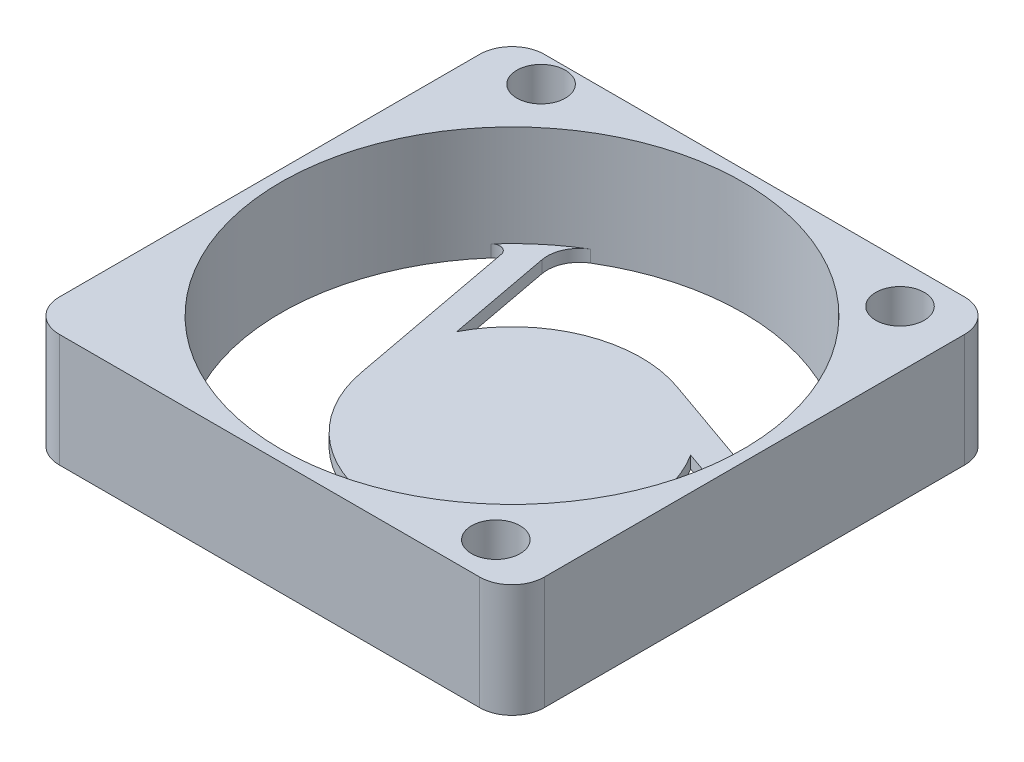
ISO-10303-21;
HEADER;
FILE_DESCRIPTION(('STEP AP214'),'2;1');
FILE_NAME('part.step','',(''),(''),'','','');
FILE_SCHEMA(('AUTOMOTIVE_DESIGN { 1 0 10303 214 1 1 1 1 }'));
ENDSEC;
DATA;
#1=APPLICATION_CONTEXT('core data for automotive mechanical design processes');
#2=APPLICATION_PROTOCOL_DEFINITION('international standard','automotive_design',2000,#1);
#3=PRODUCT_CONTEXT('',#1,'mechanical');
#4=PRODUCT('Part','Part','',(#3));
#5=PRODUCT_RELATED_PRODUCT_CATEGORY('part','',(#4));
#6=PRODUCT_DEFINITION_FORMATION('','',#4);
#7=PRODUCT_DEFINITION_CONTEXT('part definition',#1,'design');
#8=PRODUCT_DEFINITION('design','',#6,#7);
#9=PRODUCT_DEFINITION_SHAPE('','',#8);
#10=(LENGTH_UNIT() NAMED_UNIT(*) SI_UNIT(.MILLI.,.METRE.));
#11=(NAMED_UNIT(*) PLANE_ANGLE_UNIT() SI_UNIT($,.RADIAN.));
#12=(NAMED_UNIT(*) SI_UNIT($,.STERADIAN.) SOLID_ANGLE_UNIT());
#13=UNCERTAINTY_MEASURE_WITH_UNIT(LENGTH_MEASURE(1.E-05),#10,'distance_accuracy_value','');
#14=(GEOMETRIC_REPRESENTATION_CONTEXT(3) GLOBAL_UNCERTAINTY_ASSIGNED_CONTEXT((#13)) GLOBAL_UNIT_ASSIGNED_CONTEXT((#10,
#11,#12)) REPRESENTATION_CONTEXT('',''));
#15=CARTESIAN_POINT('',(0.,0.,0.));
#16=DIRECTION('',(0.,0.,1.));
#17=DIRECTION('',(1.,0.,0.));
#18=AXIS2_PLACEMENT_3D('',#15,#16,#17);
#19=CARTESIAN_POINT('',(13.,0.,13.));
#20=DIRECTION('',(0.,1.,0.));
#21=DIRECTION('',(0.,0.,1.));
#22=AXIS2_PLACEMENT_3D('',#19,#20,#21);
#23=PLANE('',#22);
#24=CARTESIAN_POINT('',(0.,0.,0.));
#25=DIRECTION('',(0.,1.,0.));
#26=DIRECTION('',(0.,0.,1.));
#27=AXIS2_PLACEMENT_3D('',#24,#25,#26);
#28=CIRCLE('',#27,8.);
#29=CARTESIAN_POINT('',(6.74049606659327,0.,-4.30879481714326));
#30=VERTEX_POINT('',#29);
#31=CARTESIAN_POINT('',(5.2099932184376,0.,6.0709118478069));
#32=VERTEX_POINT('',#31);
#33=EDGE_CURVE('E305',#30,#32,#28,.F.);
#34=ORIENTED_EDGE('',*,*,#33,.T.);
#35=DIRECTION('',(0.758863980975885,0.,-0.651249152304578));
#36=VECTOR('',#35,1.);
#37=CARTESIAN_POINT('',(5.20999321843695,0.,6.07091184780746));
#38=LINE('',#37,#36);
#39=CARTESIAN_POINT('',(-3.0400135739461,0.,13.1509816162225));
#40=VERTEX_POINT('',#39);
#41=EDGE_CURVE('E282',#40,#32,#38,.T.);
#42=ORIENTED_EDGE('',*,*,#41,.F.);
#43=CARTESIAN_POINT('',(-2.71438899779381,0.,13.5304136067105));
#44=DIRECTION('',(0.,1.,0.));
#45=DIRECTION('',(0.,0.,1.));
#46=AXIS2_PLACEMENT_3D('',#43,#44,#45);
#47=CIRCLE('',#46,0.5);
#48=CARTESIAN_POINT('',(-2.81273642525011,0.,14.0206459837652));
#49=VERTEX_POINT('',#48);
#50=EDGE_CURVE('E12',#40,#49,#47,.T.);
#51=ORIENTED_EDGE('',*,*,#50,.T.);
#52=CARTESIAN_POINT('',(0.,0.,0.));
#53=DIRECTION('',(0.,1.,0.));
#54=DIRECTION('',(0.,0.,1.));
#55=AXIS2_PLACEMENT_3D('',#52,#53,#54);
#56=CIRCLE('',#55,14.3);
#57=CARTESIAN_POINT('',(14.297372810482,0.,-0.274099832340589));
#58=VERTEX_POINT('',#57);
#59=EDGE_CURVE('E301',#58,#49,#56,.F.);
#60=ORIENTED_EDGE('',*,*,#59,.F.);
#61=CARTESIAN_POINT('',(12.2977402495755,0.,-0.235764191453794));
#62=DIRECTION('',(0.,1.,0.));
#63=DIRECTION('',(0.,0.,1.));
#64=AXIS2_PLACEMENT_3D('',#61,#62,#63);
#65=CIRCLE('',#64,2.);
#66=CARTESIAN_POINT('',(12.9608820683551,0.,-2.12262479260737));
#67=VERTEX_POINT('',#66);
#68=EDGE_CURVE('E464',#58,#67,#65,.T.);
#69=ORIENTED_EDGE('',*,*,#68,.T.);
#70=DIRECTION('',(0.943430300576788,0.,0.331570909389818));
#71=VECTOR('',#70,1.);
#72=CARTESIAN_POINT('',(2.08889672915586,0.,-5.94361089363377));
#73=LINE('',#72,#71);
#74=EDGE_CURVE('E652',#30,#67,#73,.T.);
#75=ORIENTED_EDGE('',*,*,#74,.F.);
#76=EDGE_LOOP('',(#34,#42,#51,#60,#69,#75));
#77=FACE_BOUND('',#76,.T.);
#78=CARTESIAN_POINT('',(11.5,0.,12.5));
#79=DIRECTION('',(0.,1.,0.));
#80=DIRECTION('',(0.,0.,-1.));
#81=AXIS2_PLACEMENT_3D('',#78,#79,#80);
#82=CIRCLE('',#81,1.5);
#83=CARTESIAN_POINT('',(11.5,0.,11.));
#84=VERTEX_POINT('',#83);
#85=EDGE_CURVE('E356',#84,#84,#82,.T.);
#86=ORIENTED_EDGE('',*,*,#85,.T.);
#87=EDGE_LOOP('',(#86));
#88=FACE_BOUND('',#87,.T.);
#89=CARTESIAN_POINT('',(11.5,0.,-12.5));
#90=DIRECTION('',(0.,1.,0.));
#91=DIRECTION('',(0.,0.,1.));
#92=AXIS2_PLACEMENT_3D('',#89,#90,#91);
#93=CIRCLE('',#92,1.5);
#94=CARTESIAN_POINT('',(11.5,0.,-11.));
#95=VERTEX_POINT('',#94);
#96=EDGE_CURVE('E364',#95,#95,#93,.T.);
#97=ORIENTED_EDGE('',*,*,#96,.T.);
#98=EDGE_LOOP('',(#97));
#99=FACE_BOUND('',#98,.T.);
#100=CARTESIAN_POINT('',(-11.5,0.,-13.3));
#101=DIRECTION('',(0.,1.,0.));
#102=DIRECTION('',(0.,0.,1.));
#103=AXIS2_PLACEMENT_3D('',#100,#101,#102);
#104=CIRCLE('',#103,1.5);
#105=CARTESIAN_POINT('',(-11.5,0.,-11.8));
#106=VERTEX_POINT('',#105);
#107=EDGE_CURVE('E370',#106,#106,#104,.T.);
#108=ORIENTED_EDGE('',*,*,#107,.T.);
#109=EDGE_LOOP('',(#108));
#110=FACE_BOUND('',#109,.T.);
#111=CARTESIAN_POINT('',(13.,0.,13.));
#112=DIRECTION('',(0.,1.,0.));
#113=DIRECTION('',(0.,0.,1.));
#114=AXIS2_PLACEMENT_3D('',#111,#112,#113);
#115=CIRCLE('',#114,2.);
#116=CARTESIAN_POINT('',(13.,0.,15.));
#117=VERTEX_POINT('',#116);
#118=CARTESIAN_POINT('',(15.,0.,13.));
#119=VERTEX_POINT('',#118);
#120=EDGE_CURVE('E376',#117,#119,#115,.T.);
#121=ORIENTED_EDGE('',*,*,#120,.F.);
#122=DIRECTION('',(1.,0.,0.));
#123=VECTOR('',#122,1.);
#124=CARTESIAN_POINT('',(-13.,0.,15.));
#125=LINE('',#124,#123);
#126=CARTESIAN_POINT('',(-13.,0.,15.));
#127=VERTEX_POINT('',#126);
#128=EDGE_CURVE('E383',#127,#117,#125,.T.);
#129=ORIENTED_EDGE('',*,*,#128,.F.);
#130=CARTESIAN_POINT('',(-13.,0.,13.));
#131=DIRECTION('',(0.,1.,0.));
#132=DIRECTION('',(0.,0.,-1.));
#133=AXIS2_PLACEMENT_3D('',#130,#131,#132);
#134=CIRCLE('',#133,2.);
#135=CARTESIAN_POINT('',(-15.,0.,13.));
#136=VERTEX_POINT('',#135);
#137=EDGE_CURVE('E410',#136,#127,#134,.T.);
#138=ORIENTED_EDGE('',*,*,#137,.F.);
#139=DIRECTION('',(0.,0.,1.));
#140=VECTOR('',#139,1.);
#141=CARTESIAN_POINT('',(-15.,0.,13.));
#142=LINE('',#141,#140);
#143=CARTESIAN_POINT('',(-15.,0.,-13.));
#144=VERTEX_POINT('',#143);
#145=EDGE_CURVE('E408',#144,#136,#142,.T.);
#146=ORIENTED_EDGE('',*,*,#145,.F.);
#147=CARTESIAN_POINT('',(-13.,0.,-13.));
#148=DIRECTION('',(0.,1.,0.));
#149=DIRECTION('',(0.,0.,-1.));
#150=AXIS2_PLACEMENT_3D('',#147,#148,#149);
#151=CIRCLE('',#150,2.);
#152=CARTESIAN_POINT('',(-13.,0.,-15.));
#153=VERTEX_POINT('',#152);
#154=EDGE_CURVE('E406',#153,#144,#151,.T.);
#155=ORIENTED_EDGE('',*,*,#154,.F.);
#156=DIRECTION('',(-1.,0.,0.));
#157=VECTOR('',#156,1.);
#158=CARTESIAN_POINT('',(-13.,0.,-15.));
#159=LINE('',#158,#157);
#160=CARTESIAN_POINT('',(13.,0.,-15.));
#161=VERTEX_POINT('',#160);
#162=EDGE_CURVE('E404',#161,#153,#159,.T.);
#163=ORIENTED_EDGE('',*,*,#162,.F.);
#164=CARTESIAN_POINT('',(13.,0.,-13.));
#165=DIRECTION('',(0.,1.,0.));
#166=DIRECTION('',(0.,0.,-1.));
#167=AXIS2_PLACEMENT_3D('',#164,#165,#166);
#168=CIRCLE('',#167,2.);
#169=CARTESIAN_POINT('',(15.,0.,-13.));
#170=VERTEX_POINT('',#169);
#171=EDGE_CURVE('E402',#170,#161,#168,.T.);
#172=ORIENTED_EDGE('',*,*,#171,.F.);
#173=DIRECTION('',(0.,0.,-1.));
#174=VECTOR('',#173,1.);
#175=CARTESIAN_POINT('',(15.,0.,13.));
#176=LINE('',#175,#174);
#177=EDGE_CURVE('E400',#119,#170,#176,.T.);
#178=ORIENTED_EDGE('',*,*,#177,.F.);
#179=EDGE_LOOP('',(#121,#129,#138,#146,#155,#163,#172,#178));
#180=FACE_BOUND('',#179,.T.);
#181=CARTESIAN_POINT('',(0.,0.,0.));
#182=DIRECTION('',(0.,1.,0.));
#183=DIRECTION('',(0.,0.,1.));
#184=AXIS2_PLACEMENT_3D('',#181,#182,#183);
#185=CIRCLE('',#184,8.);
#186=CARTESIAN_POINT('',(0.361277738045123,0.,7.99183823635031));
#187=VERTEX_POINT('',#186);
#188=CARTESIAN_POINT('',(-7.86256049355453,0.,1.47653055680798));
#189=VERTEX_POINT('',#188);
#190=EDGE_CURVE('E337',#187,#189,#185,.F.);
#191=ORIENTED_EDGE('',*,*,#190,.T.);
#192=DIRECTION('',(0.184566319600904,0.,0.982820061694397));
#193=VECTOR('',#192,1.);
#194=CARTESIAN_POINT('',(-7.86256049355469,0.,1.47653055680714));
#195=LINE('',#194,#193);
#196=CARTESIAN_POINT('',(-9.86907737737697,0.,-9.20821979099905));
#197=VERTEX_POINT('',#196);
#198=EDGE_CURVE('E340',#197,#189,#195,.T.);
#199=ORIENTED_EDGE('',*,*,#198,.F.);
#200=CARTESIAN_POINT('',(-10.3604874082242,0.,-9.11593663119859));
#201=DIRECTION('',(0.,1.,0.));
#202=DIRECTION('',(0.,0.,1.));
#203=AXIS2_PLACEMENT_3D('',#200,#201,#202);
#204=CIRCLE('',#203,0.5);
#205=CARTESIAN_POINT('',(-10.735867386783,0.,-9.44622419029999));
#206=VERTEX_POINT('',#205);
#207=EDGE_CURVE('E482',#197,#206,#204,.T.);
#208=ORIENTED_EDGE('',*,*,#207,.T.);
#209=CARTESIAN_POINT('',(0.,0.,0.));
#210=DIRECTION('',(0.,1.,0.));
#211=DIRECTION('',(0.,0.,1.));
#212=AXIS2_PLACEMENT_3D('',#209,#210,#211);
#213=CIRCLE('',#212,14.3);
#214=CARTESIAN_POINT('',(-6.91130898726047,0.,12.5189379774249));
#215=VERTEX_POINT('',#214);
#216=EDGE_CURVE('E330',#215,#206,#213,.F.);
#217=ORIENTED_EDGE('',*,*,#216,.F.);
#218=CARTESIAN_POINT('',(-5.94469234568558,0.,10.7680375610019));
#219=DIRECTION('',(0.,1.,0.));
#220=DIRECTION('',(0.,0.,1.));
#221=AXIS2_PLACEMENT_3D('',#218,#219,#220);
#222=CIRCLE('',#221,2.);
#223=CARTESIAN_POINT('',(-4.64219404107642,0.,12.2857655229536));
#224=VERTEX_POINT('',#223);
#225=EDGE_CURVE('E459',#215,#224,#222,.T.);
#226=ORIENTED_EDGE('',*,*,#225,.T.);
#227=DIRECTION('',(-0.758863980975885,0.,0.651249152304579));
#228=VECTOR('',#227,1.);
#229=CARTESIAN_POINT('',(4.10286965951916,0.,4.78084308014845));
#230=LINE('',#229,#228);
#231=EDGE_CURVE('E333',#187,#224,#230,.T.);
#232=ORIENTED_EDGE('',*,*,#231,.F.);
#233=EDGE_LOOP('',(#191,#199,#208,#217,#226,#232));
#234=FACE_BOUND('',#233,.T.);
#235=CARTESIAN_POINT('',(0.,0.,0.));
#236=DIRECTION('',(0.,1.,0.));
#237=DIRECTION('',(0.,0.,1.));
#238=AXIS2_PLACEMENT_3D('',#235,#236,#237);
#239=CIRCLE('',#238,8.);
#240=CARTESIAN_POINT('',(-7.10177380463679,0.,-3.68304341920648));
#241=VERTEX_POINT('',#240);
#242=CARTESIAN_POINT('',(2.65256727511854,0.,-7.5474424046143));
#243=VERTEX_POINT('',#242);
#244=EDGE_CURVE('E313',#241,#243,#239,.F.);
#245=ORIENTED_EDGE('',*,*,#244,.T.);
#246=DIRECTION('',(-0.943430300576788,0.,-0.331570909389818));
#247=VECTOR('',#246,1.);
#248=CARTESIAN_POINT('',(2.65256727511855,0.,-7.5474424046143));
#249=LINE('',#248,#247);
#250=CARTESIAN_POINT('',(12.9090909513241,0.,-3.94276182522382));
#251=VERTEX_POINT('',#250);
#252=EDGE_CURVE('E316',#251,#243,#249,.T.);
#253=ORIENTED_EDGE('',*,*,#252,.F.);
#254=CARTESIAN_POINT('',(13.074876406019,0.,-4.41447697551221));
#255=DIRECTION('',(0.,1.,0.));
#256=DIRECTION('',(0.,0.,1.));
#257=AXIS2_PLACEMENT_3D('',#254,#255,#256);
#258=CIRCLE('',#257,0.5);
#259=CARTESIAN_POINT('',(13.5486038120342,0.,-4.57442179346556));
#260=VERTEX_POINT('',#259);
#261=EDGE_CURVE('E486',#251,#260,#258,.T.);
#262=ORIENTED_EDGE('',*,*,#261,.T.);
#263=CARTESIAN_POINT('',(0.,0.,0.));
#264=DIRECTION('',(0.,1.,0.));
#265=DIRECTION('',(0.,0.,1.));
#266=AXIS2_PLACEMENT_3D('',#263,#264,#265);
#267=CIRCLE('',#266,14.3);
#268=CARTESIAN_POINT('',(-7.38606382322051,0.,-12.2448381450844));
#269=VERTEX_POINT('',#268);
#270=EDGE_CURVE('E306',#269,#260,#267,.F.);
#271=ORIENTED_EDGE('',*,*,#270,.F.);
#272=CARTESIAN_POINT('',(-6.35304790388897,0.,-10.5322733695481));
#273=DIRECTION('',(0.,1.,0.));
#274=DIRECTION('',(0.,0.,1.));
#275=AXIS2_PLACEMENT_3D('',#272,#273,#274);
#276=CIRCLE('',#275,2.);
#277=CARTESIAN_POINT('',(-8.31868802727776,0.,-10.1631407303463));
#278=VERTEX_POINT('',#277);
#279=EDGE_CURVE('E454',#269,#278,#276,.T.);
#280=ORIENTED_EDGE('',*,*,#279,.T.);
#281=DIRECTION('',(-0.184566319600904,0.,-0.982820061694396));
#282=VECTOR('',#281,1.);
#283=CARTESIAN_POINT('',(-6.19176638867421,0.,1.1627678134856));
#284=LINE('',#283,#282);
#285=EDGE_CURVE('E309',#241,#278,#284,.T.);
#286=ORIENTED_EDGE('',*,*,#285,.F.);
#287=EDGE_LOOP('',(#245,#253,#262,#271,#280,#286));
#288=FACE_BOUND('',#287,.T.);
#289=ADVANCED_FACE('F108',(#77,#88,#99,#110,#180,#234,#288),#23,.F.);
#290=CARTESIAN_POINT('',(13.,7.,13.));
#291=DIRECTION('',(0.,1.,0.));
#292=DIRECTION('',(0.,0.,1.));
#293=AXIS2_PLACEMENT_3D('',#290,#291,#292);
#294=PLANE('',#293);
#295=CARTESIAN_POINT('',(0.,7.,0.));
#296=DIRECTION('',(0.,1.,0.));
#297=DIRECTION('',(0.,0.,1.));
#298=AXIS2_PLACEMENT_3D('',#295,#296,#297);
#299=CIRCLE('',#298,14.3);
#300=CARTESIAN_POINT('',(0.,7.,14.3));
#301=VERTEX_POINT('',#300);
#302=EDGE_CURVE('E353',#301,#301,#299,.T.);
#303=ORIENTED_EDGE('',*,*,#302,.F.);
#304=EDGE_LOOP('',(#303));
#305=FACE_BOUND('',#304,.T.);
#306=CARTESIAN_POINT('',(11.5,7.,-12.5));
#307=DIRECTION('',(0.,1.,0.));
#308=DIRECTION('',(0.,0.,1.));
#309=AXIS2_PLACEMENT_3D('',#306,#307,#308);
#310=CIRCLE('',#309,1.5);
#311=CARTESIAN_POINT('',(11.5,7.,-11.));
#312=VERTEX_POINT('',#311);
#313=EDGE_CURVE('E367',#312,#312,#310,.T.);
#314=ORIENTED_EDGE('',*,*,#313,.F.);
#315=EDGE_LOOP('',(#314));
#316=FACE_BOUND('',#315,.T.);
#317=CARTESIAN_POINT('',(13.,7.,13.));
#318=DIRECTION('',(0.,1.,0.));
#319=DIRECTION('',(0.,0.,1.));
#320=AXIS2_PLACEMENT_3D('',#317,#318,#319);
#321=CIRCLE('',#320,2.);
#322=CARTESIAN_POINT('',(13.,7.,15.));
#323=VERTEX_POINT('',#322);
#324=CARTESIAN_POINT('',(15.,7.,13.));
#325=VERTEX_POINT('',#324);
#326=EDGE_CURVE('E379',#323,#325,#321,.T.);
#327=ORIENTED_EDGE('',*,*,#326,.T.);
#328=DIRECTION('',(0.,0.,-1.));
#329=VECTOR('',#328,1.);
#330=CARTESIAN_POINT('',(15.,7.,13.));
#331=LINE('',#330,#329);
#332=CARTESIAN_POINT('',(15.,7.,-13.));
#333=VERTEX_POINT('',#332);
#334=EDGE_CURVE('E382',#325,#333,#331,.T.);
#335=ORIENTED_EDGE('',*,*,#334,.T.);
#336=CARTESIAN_POINT('',(13.,7.,-13.));
#337=DIRECTION('',(0.,1.,0.));
#338=DIRECTION('',(0.,0.,-1.));
#339=AXIS2_PLACEMENT_3D('',#336,#337,#338);
#340=CIRCLE('',#339,2.);
#341=CARTESIAN_POINT('',(13.,7.,-15.));
#342=VERTEX_POINT('',#341);
#343=EDGE_CURVE('E385',#333,#342,#340,.T.);
#344=ORIENTED_EDGE('',*,*,#343,.T.);
#345=DIRECTION('',(-1.,0.,0.));
#346=VECTOR('',#345,1.);
#347=CARTESIAN_POINT('',(-13.,7.,-15.));
#348=LINE('',#347,#346);
#349=CARTESIAN_POINT('',(-13.,7.,-15.));
#350=VERTEX_POINT('',#349);
#351=EDGE_CURVE('E387',#342,#350,#348,.T.);
#352=ORIENTED_EDGE('',*,*,#351,.T.);
#353=CARTESIAN_POINT('',(-13.,7.,-13.));
#354=DIRECTION('',(0.,1.,0.));
#355=DIRECTION('',(0.,0.,-1.));
#356=AXIS2_PLACEMENT_3D('',#353,#354,#355);
#357=CIRCLE('',#356,2.);
#358=CARTESIAN_POINT('',(-15.,7.,-13.));
#359=VERTEX_POINT('',#358);
#360=EDGE_CURVE('E389',#350,#359,#357,.T.);
#361=ORIENTED_EDGE('',*,*,#360,.T.);
#362=DIRECTION('',(0.,0.,1.));
#363=VECTOR('',#362,1.);
#364=CARTESIAN_POINT('',(-15.,7.,13.));
#365=LINE('',#364,#363);
#366=CARTESIAN_POINT('',(-15.,7.,13.));
#367=VERTEX_POINT('',#366);
#368=EDGE_CURVE('E391',#359,#367,#365,.T.);
#369=ORIENTED_EDGE('',*,*,#368,.T.);
#370=CARTESIAN_POINT('',(-13.,7.,13.));
#371=DIRECTION('',(0.,1.,0.));
#372=DIRECTION('',(0.,0.,-1.));
#373=AXIS2_PLACEMENT_3D('',#370,#371,#372);
#374=CIRCLE('',#373,2.);
#375=CARTESIAN_POINT('',(-13.,7.,15.));
#376=VERTEX_POINT('',#375);
#377=EDGE_CURVE('E393',#367,#376,#374,.T.);
#378=ORIENTED_EDGE('',*,*,#377,.T.);
#379=DIRECTION('',(1.,0.,0.));
#380=VECTOR('',#379,1.);
#381=CARTESIAN_POINT('',(-13.,7.,15.));
#382=LINE('',#381,#380);
#383=EDGE_CURVE('E395',#376,#323,#382,.T.);
#384=ORIENTED_EDGE('',*,*,#383,.T.);
#385=EDGE_LOOP('',(#327,#335,#344,#352,#361,#369,#378,#384));
#386=FACE_BOUND('',#385,.T.);
#387=CARTESIAN_POINT('',(-11.5,7.,-13.3));
#388=DIRECTION('',(0.,1.,0.));
#389=DIRECTION('',(0.,0.,1.));
#390=AXIS2_PLACEMENT_3D('',#387,#388,#389);
#391=CIRCLE('',#390,1.5);
#392=CARTESIAN_POINT('',(-11.5,7.,-11.8));
#393=VERTEX_POINT('',#392);
#394=EDGE_CURVE('E373',#393,#393,#391,.T.);
#395=ORIENTED_EDGE('',*,*,#394,.F.);
#396=EDGE_LOOP('',(#395));
#397=FACE_BOUND('',#396,.T.);
#398=CARTESIAN_POINT('',(11.5,7.,12.5));
#399=DIRECTION('',(0.,1.,0.));
#400=DIRECTION('',(0.,0.,-1.));
#401=AXIS2_PLACEMENT_3D('',#398,#399,#400);
#402=CIRCLE('',#401,1.5);
#403=CARTESIAN_POINT('',(11.5,7.,11.));
#404=VERTEX_POINT('',#403);
#405=EDGE_CURVE('E361',#404,#404,#402,.T.);
#406=ORIENTED_EDGE('',*,*,#405,.F.);
#407=EDGE_LOOP('',(#406));
#408=FACE_BOUND('',#407,.T.);
#409=ADVANCED_FACE('F528',(#305,#316,#386,#397,#408),#294,.T.);
#410=CARTESIAN_POINT('',(13.,7.,13.));
#411=DIRECTION('',(0.,-1.,0.));
#412=DIRECTION('',(0.,0.,-1.));
#413=AXIS2_PLACEMENT_3D('',#410,#411,#412);
#414=CYLINDRICAL_SURFACE('',#413,2.);
#415=ORIENTED_EDGE('',*,*,#120,.T.);
#416=DIRECTION('',(0.,-1.,0.));
#417=VECTOR('',#416,1.);
#418=CARTESIAN_POINT('',(15.,7.,13.));
#419=LINE('',#418,#417);
#420=EDGE_CURVE('E433',#325,#119,#419,.T.);
#421=ORIENTED_EDGE('',*,*,#420,.F.);
#422=ORIENTED_EDGE('',*,*,#326,.F.);
#423=DIRECTION('',(0.,-1.,0.));
#424=VECTOR('',#423,1.);
#425=CARTESIAN_POINT('',(13.,7.,15.));
#426=LINE('',#425,#424);
#427=EDGE_CURVE('E397',#323,#117,#426,.T.);
#428=ORIENTED_EDGE('',*,*,#427,.T.);
#429=EDGE_LOOP('',(#415,#421,#422,#428));
#430=FACE_BOUND('',#429,.T.);
#431=ADVANCED_FACE('F534',(#430),#414,.T.);
#432=CARTESIAN_POINT('',(15.,7.,13.));
#433=DIRECTION('',(-1.,0.,0.));
#434=DIRECTION('',(0.,0.,1.));
#435=AXIS2_PLACEMENT_3D('',#432,#433,#434);
#436=PLANE('',#435);
#437=ORIENTED_EDGE('',*,*,#177,.T.);
#438=DIRECTION('',(0.,-1.,0.));
#439=VECTOR('',#438,1.);
#440=CARTESIAN_POINT('',(15.,7.,-13.));
#441=LINE('',#440,#439);
#442=EDGE_CURVE('E430',#333,#170,#441,.T.);
#443=ORIENTED_EDGE('',*,*,#442,.F.);
#444=ORIENTED_EDGE('',*,*,#334,.F.);
#445=ORIENTED_EDGE('',*,*,#420,.T.);
#446=EDGE_LOOP('',(#437,#443,#444,#445));
#447=FACE_BOUND('',#446,.T.);
#448=ADVANCED_FACE('F564',(#447),#436,.F.);
#449=CARTESIAN_POINT('',(13.,7.,-13.));
#450=DIRECTION('',(0.,-1.,0.));
#451=DIRECTION('',(0.,0.,-1.));
#452=AXIS2_PLACEMENT_3D('',#449,#450,#451);
#453=CYLINDRICAL_SURFACE('',#452,2.);
#454=ORIENTED_EDGE('',*,*,#171,.T.);
#455=DIRECTION('',(0.,-1.,0.));
#456=VECTOR('',#455,1.);
#457=CARTESIAN_POINT('',(13.,7.,-15.));
#458=LINE('',#457,#456);
#459=EDGE_CURVE('E427',#342,#161,#458,.T.);
#460=ORIENTED_EDGE('',*,*,#459,.F.);
#461=ORIENTED_EDGE('',*,*,#343,.F.);
#462=ORIENTED_EDGE('',*,*,#442,.T.);
#463=EDGE_LOOP('',(#454,#460,#461,#462));
#464=FACE_BOUND('',#463,.T.);
#465=ADVANCED_FACE('F560',(#464),#453,.T.);
#466=CARTESIAN_POINT('',(-13.,7.,-15.));
#467=DIRECTION('',(0.,0.,1.));
#468=DIRECTION('',(1.,0.,0.));
#469=AXIS2_PLACEMENT_3D('',#466,#467,#468);
#470=PLANE('',#469);
#471=ORIENTED_EDGE('',*,*,#162,.T.);
#472=DIRECTION('',(0.,-1.,0.));
#473=VECTOR('',#472,1.);
#474=CARTESIAN_POINT('',(-13.,7.,-15.));
#475=LINE('',#474,#473);
#476=EDGE_CURVE('E424',#350,#153,#475,.T.);
#477=ORIENTED_EDGE('',*,*,#476,.F.);
#478=ORIENTED_EDGE('',*,*,#351,.F.);
#479=ORIENTED_EDGE('',*,*,#459,.T.);
#480=EDGE_LOOP('',(#471,#477,#478,#479));
#481=FACE_BOUND('',#480,.T.);
#482=ADVANCED_FACE('F556',(#481),#470,.F.);
#483=CARTESIAN_POINT('',(-13.,7.,-13.));
#484=DIRECTION('',(0.,-1.,0.));
#485=DIRECTION('',(0.,0.,-1.));
#486=AXIS2_PLACEMENT_3D('',#483,#484,#485);
#487=CYLINDRICAL_SURFACE('',#486,2.);
#488=ORIENTED_EDGE('',*,*,#154,.T.);
#489=DIRECTION('',(0.,-1.,0.));
#490=VECTOR('',#489,1.);
#491=CARTESIAN_POINT('',(-15.,7.,-13.));
#492=LINE('',#491,#490);
#493=EDGE_CURVE('E421',#359,#144,#492,.T.);
#494=ORIENTED_EDGE('',*,*,#493,.F.);
#495=ORIENTED_EDGE('',*,*,#360,.F.);
#496=ORIENTED_EDGE('',*,*,#476,.T.);
#497=EDGE_LOOP('',(#488,#494,#495,#496));
#498=FACE_BOUND('',#497,.T.);
#499=ADVANCED_FACE('F552',(#498),#487,.T.);
#500=CARTESIAN_POINT('',(-15.,7.,13.));
#501=DIRECTION('',(1.,0.,0.));
#502=DIRECTION('',(0.,0.,-1.));
#503=AXIS2_PLACEMENT_3D('',#500,#501,#502);
#504=PLANE('',#503);
#505=ORIENTED_EDGE('',*,*,#145,.T.);
#506=DIRECTION('',(0.,-1.,0.));
#507=VECTOR('',#506,1.);
#508=CARTESIAN_POINT('',(-15.,7.,13.));
#509=LINE('',#508,#507);
#510=EDGE_CURVE('E418',#367,#136,#509,.T.);
#511=ORIENTED_EDGE('',*,*,#510,.F.);
#512=ORIENTED_EDGE('',*,*,#368,.F.);
#513=ORIENTED_EDGE('',*,*,#493,.T.);
#514=EDGE_LOOP('',(#505,#511,#512,#513));
#515=FACE_BOUND('',#514,.T.);
#516=ADVANCED_FACE('F548',(#515),#504,.F.);
#517=CARTESIAN_POINT('',(-13.,7.,13.));
#518=DIRECTION('',(0.,-1.,0.));
#519=DIRECTION('',(0.,0.,-1.));
#520=AXIS2_PLACEMENT_3D('',#517,#518,#519);
#521=CYLINDRICAL_SURFACE('',#520,2.);
#522=ORIENTED_EDGE('',*,*,#137,.T.);
#523=DIRECTION('',(0.,-1.,0.));
#524=VECTOR('',#523,1.);
#525=CARTESIAN_POINT('',(-13.,7.,15.));
#526=LINE('',#525,#524);
#527=EDGE_CURVE('E415',#376,#127,#526,.T.);
#528=ORIENTED_EDGE('',*,*,#527,.F.);
#529=ORIENTED_EDGE('',*,*,#377,.F.);
#530=ORIENTED_EDGE('',*,*,#510,.T.);
#531=EDGE_LOOP('',(#522,#528,#529,#530));
#532=FACE_BOUND('',#531,.T.);
#533=ADVANCED_FACE('F544',(#532),#521,.T.);
#534=CARTESIAN_POINT('',(-13.,7.,15.));
#535=DIRECTION('',(0.,0.,-1.));
#536=DIRECTION('',(-1.,0.,0.));
#537=AXIS2_PLACEMENT_3D('',#534,#535,#536);
#538=PLANE('',#537);
#539=ORIENTED_EDGE('',*,*,#128,.T.);
#540=ORIENTED_EDGE('',*,*,#427,.F.);
#541=ORIENTED_EDGE('',*,*,#383,.F.);
#542=ORIENTED_EDGE('',*,*,#527,.T.);
#543=EDGE_LOOP('',(#539,#540,#541,#542));
#544=FACE_BOUND('',#543,.T.);
#545=ADVANCED_FACE('F540',(#544),#538,.F.);
#546=CARTESIAN_POINT('',(-11.5,7.,-13.3));
#547=DIRECTION('',(0.,-1.,0.));
#548=DIRECTION('',(0.,0.,-1.));
#549=AXIS2_PLACEMENT_3D('',#546,#547,#548);
#550=CYLINDRICAL_SURFACE('',#549,1.5);
#551=ORIENTED_EDGE('',*,*,#394,.T.);
#552=EDGE_LOOP('',(#551));
#553=FACE_BOUND('',#552,.T.);
#554=ORIENTED_EDGE('',*,*,#107,.F.);
#555=EDGE_LOOP('',(#554));
#556=FACE_BOUND('',#555,.T.);
#557=ADVANCED_FACE('F543',(#553,#556),#550,.F.);
#558=CARTESIAN_POINT('',(11.5,7.,-12.5));
#559=DIRECTION('',(0.,-1.,0.));
#560=DIRECTION('',(0.,0.,-1.));
#561=AXIS2_PLACEMENT_3D('',#558,#559,#560);
#562=CYLINDRICAL_SURFACE('',#561,1.5);
#563=ORIENTED_EDGE('',*,*,#313,.T.);
#564=EDGE_LOOP('',(#563));
#565=FACE_BOUND('',#564,.T.);
#566=ORIENTED_EDGE('',*,*,#96,.F.);
#567=EDGE_LOOP('',(#566));
#568=FACE_BOUND('',#567,.T.);
#569=ADVANCED_FACE('F605',(#565,#568),#562,.F.);
#570=CARTESIAN_POINT('',(11.5,7.,12.5));
#571=DIRECTION('',(0.,-1.,0.));
#572=DIRECTION('',(0.,0.,-1.));
#573=AXIS2_PLACEMENT_3D('',#570,#571,#572);
#574=CYLINDRICAL_SURFACE('',#573,1.5);
#575=ORIENTED_EDGE('',*,*,#405,.T.);
#576=EDGE_LOOP('',(#575));
#577=FACE_BOUND('',#576,.T.);
#578=ORIENTED_EDGE('',*,*,#85,.F.);
#579=EDGE_LOOP('',(#578));
#580=FACE_BOUND('',#579,.T.);
#581=ADVANCED_FACE('F602',(#577,#580),#574,.F.);
#582=CARTESIAN_POINT('',(0.,0.75,0.));
#583=DIRECTION('',(0.,1.,0.));
#584=DIRECTION('',(0.,0.,1.));
#585=AXIS2_PLACEMENT_3D('',#582,#583,#584);
#586=CYLINDRICAL_SURFACE('',#585,14.3);
#587=ORIENTED_EDGE('',*,*,#216,.T.);
#588=DIRECTION('',(0.,1.,0.));
#589=VECTOR('',#588,1.);
#590=CARTESIAN_POINT('',(-10.735867386783,0.75,-9.44622419029999));
#591=LINE('',#590,#589);
#592=CARTESIAN_POINT('',(-10.735867386783,0.75,-9.44622419029999));
#593=VERTEX_POINT('',#592);
#594=EDGE_CURVE('E472',#206,#593,#591,.T.);
#595=ORIENTED_EDGE('',*,*,#594,.T.);
#596=CARTESIAN_POINT('',(0.,0.75,0.));
#597=DIRECTION('',(0.,1.,0.));
#598=DIRECTION('',(0.,0.,1.));
#599=AXIS2_PLACEMENT_3D('',#596,#597,#598);
#600=CIRCLE('',#599,14.3);
#601=CARTESIAN_POINT('',(-7.38606382322051,0.75,-12.2448381450844));
#602=VERTEX_POINT('',#601);
#603=EDGE_CURVE('E357',#602,#593,#600,.T.);
#604=ORIENTED_EDGE('',*,*,#603,.F.);
#605=DIRECTION('',(0.,1.,0.));
#606=VECTOR('',#605,1.);
#607=CARTESIAN_POINT('',(-7.38606382322051,0.75,-12.2448381450844));
#608=LINE('',#607,#606);
#609=EDGE_CURVE('E443',#602,#269,#608,.F.);
#610=ORIENTED_EDGE('',*,*,#609,.T.);
#611=ORIENTED_EDGE('',*,*,#270,.T.);
#612=DIRECTION('',(0.,1.,0.));
#613=VECTOR('',#612,1.);
#614=CARTESIAN_POINT('',(13.5486038120342,0.75,-4.57442179346556));
#615=LINE('',#614,#613);
#616=CARTESIAN_POINT('',(13.5486038120342,0.75,-4.57442179346556));
#617=VERTEX_POINT('',#616);
#618=EDGE_CURVE('E469',#260,#617,#615,.T.);
#619=ORIENTED_EDGE('',*,*,#618,.T.);
#620=CARTESIAN_POINT('',(14.297372810482,0.75,-0.274099832340589));
#621=VERTEX_POINT('',#620);
#622=EDGE_CURVE('E354',#621,#617,#600,.T.);
#623=ORIENTED_EDGE('',*,*,#622,.F.);
#624=DIRECTION('',(0.,1.,0.));
#625=VECTOR('',#624,1.);
#626=CARTESIAN_POINT('',(14.297372810482,0.75,-0.274099832340589));
#627=LINE('',#626,#625);
#628=EDGE_CURVE('E439',#621,#58,#627,.F.);
#629=ORIENTED_EDGE('',*,*,#628,.T.);
#630=ORIENTED_EDGE('',*,*,#59,.T.);
#631=DIRECTION('',(0.,1.,0.));
#632=VECTOR('',#631,1.);
#633=CARTESIAN_POINT('',(-2.81273642525011,0.75,14.0206459837652));
#634=LINE('',#633,#632);
#635=CARTESIAN_POINT('',(-2.81273642525011,0.75,14.0206459837652));
#636=VERTEX_POINT('',#635);
#637=EDGE_CURVE('E466',#49,#636,#634,.T.);
#638=ORIENTED_EDGE('',*,*,#637,.T.);
#639=CARTESIAN_POINT('',(-6.91130898726047,0.75,12.5189379774249));
#640=VERTEX_POINT('',#639);
#641=EDGE_CURVE('E358',#640,#636,#600,.T.);
#642=ORIENTED_EDGE('',*,*,#641,.F.);
#643=DIRECTION('',(0.,1.,0.));
#644=VECTOR('',#643,1.);
#645=CARTESIAN_POINT('',(-6.91130898726047,0.75,12.5189379774249));
#646=LINE('',#645,#644);
#647=EDGE_CURVE('E441',#640,#215,#646,.F.);
#648=ORIENTED_EDGE('',*,*,#647,.T.);
#649=EDGE_LOOP('',(#587,#595,#604,#610,#611,#619,#623,#629,#630,#638,#642,#648));
#650=FACE_BOUND('',#649,.T.);
#651=ORIENTED_EDGE('',*,*,#302,.T.);
#652=EDGE_LOOP('',(#651));
#653=FACE_BOUND('',#652,.T.);
#654=ADVANCED_FACE('F496',(#650,#653),#586,.F.);
#655=CARTESIAN_POINT('',(0.,0.75,0.));
#656=DIRECTION('',(0.,1.,0.));
#657=DIRECTION('',(0.,0.,1.));
#658=AXIS2_PLACEMENT_3D('',#655,#656,#657);
#659=PLANE('',#658);
#660=DIRECTION('',(0.943430300576788,0.,0.331570909389818));
#661=VECTOR('',#660,1.);
#662=CARTESIAN_POINT('',(2.65256727511855,0.75,-7.5474424046143));
#663=LINE('',#662,#661);
#664=CARTESIAN_POINT('',(2.65256727511854,0.75,-7.5474424046143));
#665=VERTEX_POINT('',#664);
#666=CARTESIAN_POINT('',(12.9090909513241,0.75,-3.94276182522382));
#667=VERTEX_POINT('',#666);
#668=EDGE_CURVE('E319',#665,#667,#663,.T.);
#669=ORIENTED_EDGE('',*,*,#668,.F.);
#670=CARTESIAN_POINT('',(0.,0.75,0.));
#671=DIRECTION('',(0.,1.,0.));
#672=DIRECTION('',(0.,0.,1.));
#673=AXIS2_PLACEMENT_3D('',#670,#671,#672);
#674=CIRCLE('',#673,8.);
#675=CARTESIAN_POINT('',(-7.10177380463679,0.75,-3.68304341920648));
#676=VERTEX_POINT('',#675);
#677=EDGE_CURVE('E304',#665,#676,#674,.T.);
#678=ORIENTED_EDGE('',*,*,#677,.T.);
#679=DIRECTION('',(0.184566319600904,0.,0.982820061694397));
#680=VECTOR('',#679,1.);
#681=CARTESIAN_POINT('',(-6.19176638867421,0.75,1.1627678134856));
#682=LINE('',#681,#680);
#683=CARTESIAN_POINT('',(-8.31868802727776,0.75,-10.1631407303463));
#684=VERTEX_POINT('',#683);
#685=EDGE_CURVE('E322',#684,#676,#682,.T.);
#686=ORIENTED_EDGE('',*,*,#685,.F.);
#687=CARTESIAN_POINT('',(-6.35304790388897,0.75,-10.5322733695481));
#688=DIRECTION('',(0.,1.,0.));
#689=DIRECTION('',(0.,0.,1.));
#690=AXIS2_PLACEMENT_3D('',#687,#688,#689);
#691=CIRCLE('',#690,2.);
#692=EDGE_CURVE('E451',#684,#602,#691,.F.);
#693=ORIENTED_EDGE('',*,*,#692,.T.);
#694=ORIENTED_EDGE('',*,*,#603,.T.);
#695=CARTESIAN_POINT('',(-10.3604874082242,0.75,-9.11593663119859));
#696=DIRECTION('',(0.,1.,0.));
#697=DIRECTION('',(0.,0.,1.));
#698=AXIS2_PLACEMENT_3D('',#695,#696,#697);
#699=CIRCLE('',#698,0.5);
#700=CARTESIAN_POINT('',(-9.86907737737697,0.75,-9.20821979099905));
#701=VERTEX_POINT('',#700);
#702=EDGE_CURVE('E480',#593,#701,#699,.F.);
#703=ORIENTED_EDGE('',*,*,#702,.T.);
#704=DIRECTION('',(-0.184566319600904,0.,-0.982820061694396));
#705=VECTOR('',#704,1.);
#706=CARTESIAN_POINT('',(-7.86256049355469,0.75,1.47653055680714));
#707=LINE('',#706,#705);
#708=CARTESIAN_POINT('',(-7.86256049355453,0.75,1.47653055680798));
#709=VERTEX_POINT('',#708);
#710=EDGE_CURVE('E343',#709,#701,#707,.T.);
#711=ORIENTED_EDGE('',*,*,#710,.F.);
#712=CARTESIAN_POINT('',(0.,0.75,0.));
#713=DIRECTION('',(0.,1.,0.));
#714=DIRECTION('',(0.,0.,1.));
#715=AXIS2_PLACEMENT_3D('',#712,#713,#714);
#716=CIRCLE('',#715,8.);
#717=CARTESIAN_POINT('',(0.361277738045122,0.75,7.99183823635031));
#718=VERTEX_POINT('',#717);
#719=EDGE_CURVE('E329',#709,#718,#716,.T.);
#720=ORIENTED_EDGE('',*,*,#719,.T.);
#721=DIRECTION('',(0.758863980975885,0.,-0.651249152304579));
#722=VECTOR('',#721,1.);
#723=CARTESIAN_POINT('',(4.10286965951916,0.75,4.78084308014845));
#724=LINE('',#723,#722);
#725=CARTESIAN_POINT('',(-4.64219404107643,0.75,12.2857655229536));
#726=VERTEX_POINT('',#725);
#727=EDGE_CURVE('E346',#726,#718,#724,.T.);
#728=ORIENTED_EDGE('',*,*,#727,.F.);
#729=CARTESIAN_POINT('',(-5.94469234568558,0.75,10.7680375610019));
#730=DIRECTION('',(0.,1.,0.));
#731=DIRECTION('',(0.,0.,1.));
#732=AXIS2_PLACEMENT_3D('',#729,#730,#731);
#733=CIRCLE('',#732,2.);
#734=EDGE_CURVE('E456',#726,#640,#733,.F.);
#735=ORIENTED_EDGE('',*,*,#734,.T.);
#736=ORIENTED_EDGE('',*,*,#641,.T.);
#737=CARTESIAN_POINT('',(-2.71438899779381,0.75,13.5304136067105));
#738=DIRECTION('',(0.,1.,0.));
#739=DIRECTION('',(0.,0.,1.));
#740=AXIS2_PLACEMENT_3D('',#737,#738,#739);
#741=CIRCLE('',#740,0.5);
#742=CARTESIAN_POINT('',(-3.0400135739461,0.75,13.1509816162225));
#743=VERTEX_POINT('',#742);
#744=EDGE_CURVE('E116',#636,#743,#741,.F.);
#745=ORIENTED_EDGE('',*,*,#744,.T.);
#746=DIRECTION('',(-0.758863980975885,0.,0.651249152304578));
#747=VECTOR('',#746,1.);
#748=CARTESIAN_POINT('',(5.20999321843695,0.75,6.07091184780746));
#749=LINE('',#748,#747);
#750=CARTESIAN_POINT('',(5.2099932184376,0.75,6.0709118478069));
#751=VERTEX_POINT('',#750);
#752=EDGE_CURVE('E281',#751,#743,#749,.T.);
#753=ORIENTED_EDGE('',*,*,#752,.F.);
#754=CARTESIAN_POINT('',(0.,0.75,0.));
#755=DIRECTION('',(0.,1.,0.));
#756=DIRECTION('',(0.,0.,1.));
#757=AXIS2_PLACEMENT_3D('',#754,#755,#756);
#758=CIRCLE('',#757,8.);
#759=CARTESIAN_POINT('',(6.74049606659327,0.75,-4.30879481714326));
#760=VERTEX_POINT('',#759);
#761=EDGE_CURVE('E290',#751,#760,#758,.T.);
#762=ORIENTED_EDGE('',*,*,#761,.T.);
#763=DIRECTION('',(-0.943430300576788,0.,-0.331570909389818));
#764=VECTOR('',#763,1.);
#765=CARTESIAN_POINT('',(2.08889672915586,0.75,-5.94361089363377));
#766=LINE('',#765,#764);
#767=CARTESIAN_POINT('',(12.9608820683551,0.75,-2.12262479260737));
#768=VERTEX_POINT('',#767);
#769=EDGE_CURVE('E286',#768,#760,#766,.T.);
#770=ORIENTED_EDGE('',*,*,#769,.F.);
#771=CARTESIAN_POINT('',(12.2977402495755,0.75,-0.235764191453794));
#772=DIRECTION('',(0.,1.,0.));
#773=DIRECTION('',(0.,0.,1.));
#774=AXIS2_PLACEMENT_3D('',#771,#772,#773);
#775=CIRCLE('',#774,2.);
#776=EDGE_CURVE('E461',#768,#621,#775,.F.);
#777=ORIENTED_EDGE('',*,*,#776,.T.);
#778=ORIENTED_EDGE('',*,*,#622,.T.);
#779=CARTESIAN_POINT('',(13.074876406019,0.75,-4.41447697551221));
#780=DIRECTION('',(0.,1.,0.));
#781=DIRECTION('',(0.,0.,1.));
#782=AXIS2_PLACEMENT_3D('',#779,#780,#781);
#783=CIRCLE('',#782,0.5);
#784=EDGE_CURVE('E484',#617,#667,#783,.F.);
#785=ORIENTED_EDGE('',*,*,#784,.T.);
#786=EDGE_LOOP('',(#669,#678,#686,#693,#694,#703,#711,#720,#728,#735,#736,#745,#753,#762,#770,
#777,#778,#785));
#787=FACE_BOUND('',#786,.T.);
#788=ADVANCED_FACE('F296',(#787),#659,.T.);
#789=CARTESIAN_POINT('',(0.,-27.5407190147598,0.));
#790=DIRECTION('',(0.,1.,0.));
#791=DIRECTION('',(0.,0.,1.));
#792=AXIS2_PLACEMENT_3D('',#789,#790,#791);
#793=CYLINDRICAL_SURFACE('',#792,8.);
#794=DIRECTION('',(0.,1.,0.));
#795=VECTOR('',#794,1.);
#796=CARTESIAN_POINT('',(0.361277738045122,-27.5407190147598,7.99183823635031));
#797=LINE('',#796,#795);
#798=EDGE_CURVE('E334',#187,#718,#797,.T.);
#799=ORIENTED_EDGE('',*,*,#798,.T.);
#800=ORIENTED_EDGE('',*,*,#719,.F.);
#801=DIRECTION('',(0.,1.,0.));
#802=VECTOR('',#801,1.);
#803=CARTESIAN_POINT('',(-7.86256049355453,-27.5407190147598,1.47653055680798));
#804=LINE('',#803,#802);
#805=EDGE_CURVE('E348',#189,#709,#804,.T.);
#806=ORIENTED_EDGE('',*,*,#805,.F.);
#807=ORIENTED_EDGE('',*,*,#190,.F.);
#808=EDGE_LOOP('',(#799,#800,#806,#807));
#809=FACE_BOUND('',#808,.T.);
#810=ADVANCED_FACE('F625',(#809),#793,.T.);
#811=CARTESIAN_POINT('',(4.10286965951916,-27.5407190147598,4.78084308014845));
#812=DIRECTION('',(0.651249152304579,0.,0.758863980975885));
#813=DIRECTION('',(0.758863980975885,0.,-0.651249152304579));
#814=AXIS2_PLACEMENT_3D('',#811,#812,#813);
#815=PLANE('',#814);
#816=ORIENTED_EDGE('',*,*,#231,.T.);
#817=DIRECTION('',(0.,-1.,0.));
#818=VECTOR('',#817,1.);
#819=CARTESIAN_POINT('',(-4.64219404107642,0.75,12.2857655229536));
#820=LINE('',#819,#818);
#821=EDGE_CURVE('E445',#224,#726,#820,.F.);
#822=ORIENTED_EDGE('',*,*,#821,.T.);
#823=ORIENTED_EDGE('',*,*,#727,.T.);
#824=ORIENTED_EDGE('',*,*,#798,.F.);
#825=EDGE_LOOP('',(#816,#822,#823,#824));
#826=FACE_BOUND('',#825,.T.);
#827=ADVANCED_FACE('F628',(#826),#815,.F.);
#828=CARTESIAN_POINT('',(-7.86256049355469,-27.5407190147598,1.47653055680714));
#829=DIRECTION('',(0.982820061694396,0.,-0.184566319600904));
#830=DIRECTION('',(-0.184566319600904,0.,-0.982820061694397));
#831=AXIS2_PLACEMENT_3D('',#828,#829,#830);
#832=PLANE('',#831);
#833=ORIENTED_EDGE('',*,*,#710,.T.);
#834=DIRECTION('',(0.,-1.,0.));
#835=VECTOR('',#834,1.);
#836=CARTESIAN_POINT('',(-9.86907737737697,0.,-9.20821979099905));
#837=LINE('',#836,#835);
#838=EDGE_CURVE('E475',#701,#197,#837,.T.);
#839=ORIENTED_EDGE('',*,*,#838,.T.);
#840=ORIENTED_EDGE('',*,*,#198,.T.);
#841=ORIENTED_EDGE('',*,*,#805,.T.);
#842=EDGE_LOOP('',(#833,#839,#840,#841));
#843=FACE_BOUND('',#842,.T.);
#844=ADVANCED_FACE('F630',(#843),#832,.F.);
#845=CARTESIAN_POINT('',(0.,-27.5407190147598,0.));
#846=DIRECTION('',(0.,1.,0.));
#847=DIRECTION('',(0.,0.,1.));
#848=AXIS2_PLACEMENT_3D('',#845,#846,#847);
#849=CYLINDRICAL_SURFACE('',#848,8.);
#850=DIRECTION('',(0.,1.,0.));
#851=VECTOR('',#850,1.);
#852=CARTESIAN_POINT('',(6.74049606659327,-27.5407190147598,-4.30879481714326));
#853=LINE('',#852,#851);
#854=EDGE_CURVE('E285',#30,#760,#853,.T.);
#855=ORIENTED_EDGE('',*,*,#854,.T.);
#856=ORIENTED_EDGE('',*,*,#761,.F.);
#857=DIRECTION('',(0.,1.,0.));
#858=VECTOR('',#857,1.);
#859=CARTESIAN_POINT('',(5.2099932184376,-27.5407190147598,6.0709118478069));
#860=LINE('',#859,#858);
#861=EDGE_CURVE('E278',#32,#751,#860,.T.);
#862=ORIENTED_EDGE('',*,*,#861,.F.);
#863=ORIENTED_EDGE('',*,*,#33,.F.);
#864=EDGE_LOOP('',(#855,#856,#862,#863));
#865=FACE_BOUND('',#864,.T.);
#866=ADVANCED_FACE('F291',(#865),#849,.T.);
#867=CARTESIAN_POINT('',(2.08889672915586,-27.5407190147598,-5.94361089363377));
#868=DIRECTION('',(0.331570909389818,0.,-0.943430300576788));
#869=DIRECTION('',(-0.943430300576788,0.,-0.331570909389818));
#870=AXIS2_PLACEMENT_3D('',#867,#868,#869);
#871=PLANE('',#870);
#872=ORIENTED_EDGE('',*,*,#74,.T.);
#873=DIRECTION('',(0.,-1.,0.));
#874=VECTOR('',#873,1.);
#875=CARTESIAN_POINT('',(12.9608820683551,0.75,-2.12262479260737));
#876=LINE('',#875,#874);
#877=EDGE_CURVE('E448',#67,#768,#876,.F.);
#878=ORIENTED_EDGE('',*,*,#877,.T.);
#879=ORIENTED_EDGE('',*,*,#769,.T.);
#880=ORIENTED_EDGE('',*,*,#854,.F.);
#881=EDGE_LOOP('',(#872,#878,#879,#880));
#882=FACE_BOUND('',#881,.T.);
#883=ADVANCED_FACE('F643',(#882),#871,.F.);
#884=CARTESIAN_POINT('',(5.20999321843695,-27.5407190147598,6.07091184780746));
#885=DIRECTION('',(-0.651249152304578,0.,-0.758863980975885));
#886=DIRECTION('',(-0.758863980975885,0.,0.651249152304578));
#887=AXIS2_PLACEMENT_3D('',#884,#885,#886);
#888=PLANE('',#887);
#889=ORIENTED_EDGE('',*,*,#752,.T.);
#890=DIRECTION('',(0.,-1.,0.));
#891=VECTOR('',#890,1.);
#892=CARTESIAN_POINT('',(-3.0400135739461,0.,13.1509816162225));
#893=LINE('',#892,#891);
#894=EDGE_CURVE('E129',#743,#40,#893,.T.);
#895=ORIENTED_EDGE('',*,*,#894,.T.);
#896=ORIENTED_EDGE('',*,*,#41,.T.);
#897=ORIENTED_EDGE('',*,*,#861,.T.);
#898=EDGE_LOOP('',(#889,#895,#896,#897));
#899=FACE_BOUND('',#898,.T.);
#900=ADVANCED_FACE('F280',(#899),#888,.F.);
#901=CARTESIAN_POINT('',(0.,-27.5407190147598,0.));
#902=DIRECTION('',(0.,1.,0.));
#903=DIRECTION('',(0.,0.,1.));
#904=AXIS2_PLACEMENT_3D('',#901,#902,#903);
#905=CYLINDRICAL_SURFACE('',#904,8.);
#906=DIRECTION('',(0.,1.,0.));
#907=VECTOR('',#906,1.);
#908=CARTESIAN_POINT('',(-7.10177380463679,-27.5407190147598,-3.68304341920648));
#909=LINE('',#908,#907);
#910=EDGE_CURVE('E310',#241,#676,#909,.T.);
#911=ORIENTED_EDGE('',*,*,#910,.T.);
#912=ORIENTED_EDGE('',*,*,#677,.F.);
#913=DIRECTION('',(0.,1.,0.));
#914=VECTOR('',#913,1.);
#915=CARTESIAN_POINT('',(2.65256727511854,-27.5407190147598,-7.5474424046143));
#916=LINE('',#915,#914);
#917=EDGE_CURVE('E324',#243,#665,#916,.T.);
#918=ORIENTED_EDGE('',*,*,#917,.F.);
#919=ORIENTED_EDGE('',*,*,#244,.F.);
#920=EDGE_LOOP('',(#911,#912,#918,#919));
#921=FACE_BOUND('',#920,.T.);
#922=ADVANCED_FACE('F506',(#921),#905,.T.);
#923=CARTESIAN_POINT('',(-6.19176638867421,-27.5407190147598,1.1627678134856));
#924=DIRECTION('',(-0.982820061694396,0.,0.184566319600904));
#925=DIRECTION('',(0.184566319600904,0.,0.982820061694396));
#926=AXIS2_PLACEMENT_3D('',#923,#924,#925);
#927=PLANE('',#926);
#928=ORIENTED_EDGE('',*,*,#285,.T.);
#929=DIRECTION('',(0.,-1.,0.));
#930=VECTOR('',#929,1.);
#931=CARTESIAN_POINT('',(-8.31868802727776,0.75,-10.1631407303463));
#932=LINE('',#931,#930);
#933=EDGE_CURVE('E436',#278,#684,#932,.F.);
#934=ORIENTED_EDGE('',*,*,#933,.T.);
#935=ORIENTED_EDGE('',*,*,#685,.T.);
#936=ORIENTED_EDGE('',*,*,#910,.F.);
#937=EDGE_LOOP('',(#928,#934,#935,#936));
#938=FACE_BOUND('',#937,.T.);
#939=ADVANCED_FACE('F510',(#938),#927,.F.);
#940=CARTESIAN_POINT('',(2.65256727511855,-27.5407190147598,-7.5474424046143));
#941=DIRECTION('',(-0.331570909389818,0.,0.943430300576788));
#942=DIRECTION('',(0.943430300576788,0.,0.331570909389818));
#943=AXIS2_PLACEMENT_3D('',#940,#941,#942);
#944=PLANE('',#943);
#945=ORIENTED_EDGE('',*,*,#668,.T.);
#946=DIRECTION('',(0.,-1.,0.));
#947=VECTOR('',#946,1.);
#948=CARTESIAN_POINT('',(12.9090909513241,0.,-3.94276182522382));
#949=LINE('',#948,#947);
#950=EDGE_CURVE('E477',#667,#251,#949,.T.);
#951=ORIENTED_EDGE('',*,*,#950,.T.);
#952=ORIENTED_EDGE('',*,*,#252,.T.);
#953=ORIENTED_EDGE('',*,*,#917,.T.);
#954=EDGE_LOOP('',(#945,#951,#952,#953));
#955=FACE_BOUND('',#954,.T.);
#956=ADVANCED_FACE('F502',(#955),#944,.F.);
#957=CARTESIAN_POINT('',(-6.35304790388897,0.75,-10.5322733695481));
#958=DIRECTION('',(0.,1.,0.));
#959=DIRECTION('',(0.,0.,1.));
#960=AXIS2_PLACEMENT_3D('',#957,#958,#959);
#961=CYLINDRICAL_SURFACE('',#960,2.);
#962=ORIENTED_EDGE('',*,*,#279,.F.);
#963=ORIENTED_EDGE('',*,*,#609,.F.);
#964=ORIENTED_EDGE('',*,*,#692,.F.);
#965=ORIENTED_EDGE('',*,*,#933,.F.);
#966=EDGE_LOOP('',(#962,#963,#964,#965));
#967=FACE_BOUND('',#966,.T.);
#968=ADVANCED_FACE('F514',(#967),#961,.F.);
#969=CARTESIAN_POINT('',(-5.94469234568558,0.75,10.7680375610019));
#970=DIRECTION('',(0.,1.,0.));
#971=DIRECTION('',(0.,0.,1.));
#972=AXIS2_PLACEMENT_3D('',#969,#970,#971);
#973=CYLINDRICAL_SURFACE('',#972,2.);
#974=ORIENTED_EDGE('',*,*,#225,.F.);
#975=ORIENTED_EDGE('',*,*,#647,.F.);
#976=ORIENTED_EDGE('',*,*,#734,.F.);
#977=ORIENTED_EDGE('',*,*,#821,.F.);
#978=EDGE_LOOP('',(#974,#975,#976,#977));
#979=FACE_BOUND('',#978,.T.);
#980=ADVANCED_FACE('F516',(#979),#973,.F.);
#981=CARTESIAN_POINT('',(12.2977402495755,0.75,-0.235764191453794));
#982=DIRECTION('',(0.,1.,0.));
#983=DIRECTION('',(0.,0.,1.));
#984=AXIS2_PLACEMENT_3D('',#981,#982,#983);
#985=CYLINDRICAL_SURFACE('',#984,2.);
#986=ORIENTED_EDGE('',*,*,#68,.F.);
#987=ORIENTED_EDGE('',*,*,#628,.F.);
#988=ORIENTED_EDGE('',*,*,#776,.F.);
#989=ORIENTED_EDGE('',*,*,#877,.F.);
#990=EDGE_LOOP('',(#986,#987,#988,#989));
#991=FACE_BOUND('',#990,.T.);
#992=ADVANCED_FACE('F522',(#991),#985,.F.);
#993=CARTESIAN_POINT('',(-10.3604874082242,0.75,-9.11593663119859));
#994=DIRECTION('',(0.,1.,0.));
#995=DIRECTION('',(0.,0.,1.));
#996=AXIS2_PLACEMENT_3D('',#993,#994,#995);
#997=CYLINDRICAL_SURFACE('',#996,0.5);
#998=ORIENTED_EDGE('',*,*,#207,.F.);
#999=ORIENTED_EDGE('',*,*,#838,.F.);
#1000=ORIENTED_EDGE('',*,*,#702,.F.);
#1001=ORIENTED_EDGE('',*,*,#594,.F.);
#1002=EDGE_LOOP('',(#998,#999,#1000,#1001));
#1003=FACE_BOUND('',#1002,.T.);
#1004=ADVANCED_FACE('F679',(#1003),#997,.F.);
#1005=CARTESIAN_POINT('',(13.074876406019,0.75,-4.41447697551221));
#1006=DIRECTION('',(0.,1.,0.));
#1007=DIRECTION('',(0.,0.,1.));
#1008=AXIS2_PLACEMENT_3D('',#1005,#1006,#1007);
#1009=CYLINDRICAL_SURFACE('',#1008,0.5);
#1010=ORIENTED_EDGE('',*,*,#261,.F.);
#1011=ORIENTED_EDGE('',*,*,#950,.F.);
#1012=ORIENTED_EDGE('',*,*,#784,.F.);
#1013=ORIENTED_EDGE('',*,*,#618,.F.);
#1014=EDGE_LOOP('',(#1010,#1011,#1012,#1013));
#1015=FACE_BOUND('',#1014,.T.);
#1016=ADVANCED_FACE('F500',(#1015),#1009,.F.);
#1017=CARTESIAN_POINT('',(-2.71438899779381,0.75,13.5304136067105));
#1018=DIRECTION('',(0.,1.,0.));
#1019=DIRECTION('',(0.,0.,1.));
#1020=AXIS2_PLACEMENT_3D('',#1017,#1018,#1019);
#1021=CYLINDRICAL_SURFACE('',#1020,0.5);
#1022=ORIENTED_EDGE('',*,*,#50,.F.);
#1023=ORIENTED_EDGE('',*,*,#894,.F.);
#1024=ORIENTED_EDGE('',*,*,#744,.F.);
#1025=ORIENTED_EDGE('',*,*,#637,.F.);
#1026=EDGE_LOOP('',(#1022,#1023,#1024,#1025));
#1027=FACE_BOUND('',#1026,.T.);
#1028=ADVANCED_FACE('F110',(#1027),#1021,.F.);
#1029=CLOSED_SHELL('',(#289,#409,#431,#448,#465,#482,#499,#516,#533,#545,#557,#569,#581,#654,
#788,#810,#827,#844,#866,#883,#900,#922,#939,#956,#968,#980,#992,#1004,#1016,#1028));
#1030=MANIFOLD_SOLID_BREP('B2',#1029);
#1031=ADVANCED_BREP_SHAPE_REPRESENTATION('',(#18,#1030),#14);
#1032=SHAPE_DEFINITION_REPRESENTATION(#9,#1031);
ENDSEC;
END-ISO-10303-21;
